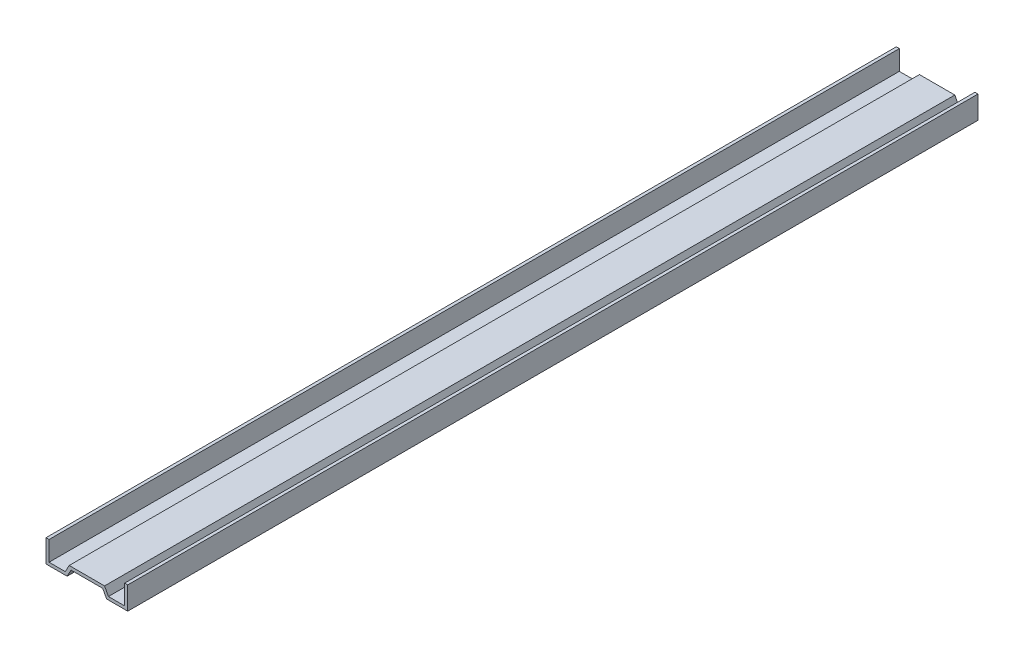
ISO-10303-21;
HEADER;
FILE_DESCRIPTION(('STEP AP214'),'2;1');
FILE_NAME('part.step','',(''),(''),'','','');
FILE_SCHEMA(('AUTOMOTIVE_DESIGN { 1 0 10303 214 1 1 1 1 }'));
ENDSEC;
DATA;
#1=APPLICATION_CONTEXT('core data for automotive mechanical design processes');
#2=APPLICATION_PROTOCOL_DEFINITION('international standard','automotive_design',2000,#1);
#3=PRODUCT_CONTEXT('',#1,'mechanical');
#4=PRODUCT('Part','Part','',(#3));
#5=PRODUCT_RELATED_PRODUCT_CATEGORY('part','',(#4));
#6=PRODUCT_DEFINITION_FORMATION('','',#4);
#7=PRODUCT_DEFINITION_CONTEXT('part definition',#1,'design');
#8=PRODUCT_DEFINITION('design','',#6,#7);
#9=PRODUCT_DEFINITION_SHAPE('','',#8);
#10=(LENGTH_UNIT() NAMED_UNIT(*) SI_UNIT(.MILLI.,.METRE.));
#11=(NAMED_UNIT(*) PLANE_ANGLE_UNIT() SI_UNIT($,.RADIAN.));
#12=(NAMED_UNIT(*) SI_UNIT($,.STERADIAN.) SOLID_ANGLE_UNIT());
#13=UNCERTAINTY_MEASURE_WITH_UNIT(LENGTH_MEASURE(1.E-05),#10,'distance_accuracy_value','');
#14=(GEOMETRIC_REPRESENTATION_CONTEXT(3) GLOBAL_UNCERTAINTY_ASSIGNED_CONTEXT((#13)) GLOBAL_UNIT_ASSIGNED_CONTEXT((#10,
#11,#12)) REPRESENTATION_CONTEXT('',''));
#15=CARTESIAN_POINT('',(0.,0.,0.));
#16=DIRECTION('',(0.,0.,1.));
#17=DIRECTION('',(1.,0.,0.));
#18=AXIS2_PLACEMENT_3D('',#15,#16,#17);
#19=CARTESIAN_POINT('',(-1.88264318030902,-0.957779943038778,135.75));
#20=DIRECTION('',(-0.88244719913486,0.470411458979307,0.));
#21=DIRECTION('',(-0.470411458979307,-0.88244719913486,0.));
#22=AXIS2_PLACEMENT_3D('',#19,#20,#21);
#23=PLANE('',#22);
#24=DIRECTION('',(-0.470411458979307,-0.88244719913486,0.));
#25=VECTOR('',#24,1.);
#26=CARTESIAN_POINT('',(-1.88264318030902,-0.957779943038778,226.25));
#27=LINE('',#26,#25);
#28=CARTESIAN_POINT('',(-1.88264318030902,-0.957779943038778,226.25));
#29=VERTEX_POINT('',#28);
#30=CARTESIAN_POINT('',(-2.29517142198211,-1.73164372649831,226.25));
#31=VERTEX_POINT('',#30);
#32=EDGE_CURVE('E189',#29,#31,#27,.T.);
#33=ORIENTED_EDGE('',*,*,#32,.F.);
#34=DIRECTION('',(0.,0.,1.));
#35=VECTOR('',#34,1.);
#36=CARTESIAN_POINT('',(-1.88264318030902,-0.957779943038778,135.75));
#37=LINE('',#36,#35);
#38=CARTESIAN_POINT('',(-1.88264318030902,-0.957779943038778,135.75));
#39=VERTEX_POINT('',#38);
#40=EDGE_CURVE('E11',#39,#29,#37,.T.);
#41=ORIENTED_EDGE('',*,*,#40,.F.);
#42=DIRECTION('',(-0.470411458979307,-0.88244719913486,0.));
#43=VECTOR('',#42,1.);
#44=CARTESIAN_POINT('',(-1.88264318030902,-0.957779943038778,135.75));
#45=LINE('',#44,#43);
#46=CARTESIAN_POINT('',(-2.29517142198211,-1.73164372649831,135.75));
#47=VERTEX_POINT('',#46);
#48=EDGE_CURVE('E249',#39,#47,#45,.T.);
#49=ORIENTED_EDGE('',*,*,#48,.T.);
#50=DIRECTION('',(0.,0.,1.));
#51=VECTOR('',#50,1.);
#52=CARTESIAN_POINT('',(-2.29517142198211,-1.73164372649831,135.75));
#53=LINE('',#52,#51);
#54=EDGE_CURVE('E41',#47,#31,#53,.T.);
#55=ORIENTED_EDGE('',*,*,#54,.T.);
#56=EDGE_LOOP('',(#33,#41,#49,#55));
#57=FACE_BOUND('',#56,.T.);
#58=ADVANCED_FACE('F38',(#57),#23,.T.);
#59=CARTESIAN_POINT('',(1.88252698306997,-0.957779943038778,135.75));
#60=DIRECTION('',(0.,1.,0.));
#61=DIRECTION('',(-1.,0.,0.));
#62=AXIS2_PLACEMENT_3D('',#59,#60,#61);
#63=PLANE('',#62);
#64=DIRECTION('',(-1.,0.,0.));
#65=VECTOR('',#64,1.);
#66=CARTESIAN_POINT('',(1.88252698306997,-0.957779943038778,226.25));
#67=LINE('',#66,#65);
#68=CARTESIAN_POINT('',(1.88252698306997,-0.957779943038778,226.25));
#69=VERTEX_POINT('',#68);
#70=EDGE_CURVE('E246',#69,#29,#67,.T.);
#71=ORIENTED_EDGE('',*,*,#70,.F.);
#72=DIRECTION('',(0.,0.,1.));
#73=VECTOR('',#72,1.);
#74=CARTESIAN_POINT('',(1.88252698306997,-0.957779943038778,135.75));
#75=LINE('',#74,#73);
#76=CARTESIAN_POINT('',(1.88252698306997,-0.957779943038778,135.75));
#77=VERTEX_POINT('',#76);
#78=EDGE_CURVE('E48',#77,#69,#75,.T.);
#79=ORIENTED_EDGE('',*,*,#78,.F.);
#80=DIRECTION('',(-1.,0.,0.));
#81=VECTOR('',#80,1.);
#82=CARTESIAN_POINT('',(1.88252698306997,-0.957779943038778,135.75));
#83=LINE('',#82,#81);
#84=EDGE_CURVE('E175',#77,#39,#83,.T.);
#85=ORIENTED_EDGE('',*,*,#84,.T.);
#86=ORIENTED_EDGE('',*,*,#40,.T.);
#87=EDGE_LOOP('',(#71,#79,#85,#86));
#88=FACE_BOUND('',#87,.T.);
#89=ADVANCED_FACE('F291',(#88),#63,.T.);
#90=CARTESIAN_POINT('',(2.29499874139688,-1.73164372649831,135.75));
#91=DIRECTION('',(0.8824739354314,0.470361300793567,0.));
#92=DIRECTION('',(-0.470361300793568,0.8824739354314,0.));
#93=AXIS2_PLACEMENT_3D('',#90,#91,#92);
#94=PLANE('',#93);
#95=DIRECTION('',(-0.470361300793568,0.8824739354314,0.));
#96=VECTOR('',#95,1.);
#97=CARTESIAN_POINT('',(2.29499874139688,-1.73164372649831,226.25));
#98=LINE('',#97,#96);
#99=CARTESIAN_POINT('',(2.29499874139688,-1.73164372649831,226.25));
#100=VERTEX_POINT('',#99);
#101=EDGE_CURVE('E161',#100,#69,#98,.T.);
#102=ORIENTED_EDGE('',*,*,#101,.F.);
#103=DIRECTION('',(0.,0.,1.));
#104=VECTOR('',#103,1.);
#105=CARTESIAN_POINT('',(2.29499874139688,-1.73164372649831,135.75));
#106=LINE('',#105,#104);
#107=CARTESIAN_POINT('',(2.29499874139688,-1.73164372649831,135.75));
#108=VERTEX_POINT('',#107);
#109=EDGE_CURVE('E156',#108,#100,#106,.T.);
#110=ORIENTED_EDGE('',*,*,#109,.F.);
#111=DIRECTION('',(-0.470361300793568,0.8824739354314,0.));
#112=VECTOR('',#111,1.);
#113=CARTESIAN_POINT('',(2.29499874139688,-1.73164372649831,135.75));
#114=LINE('',#113,#112);
#115=EDGE_CURVE('E159',#108,#77,#114,.T.);
#116=ORIENTED_EDGE('',*,*,#115,.T.);
#117=ORIENTED_EDGE('',*,*,#78,.T.);
#118=EDGE_LOOP('',(#102,#110,#116,#117));
#119=FACE_BOUND('',#118,.T.);
#120=ADVANCED_FACE('F158',(#119),#94,.T.);
#121=CARTESIAN_POINT('',(4.02494190138047,-1.73164372649831,135.75));
#122=DIRECTION('',(0.,1.,0.));
#123=DIRECTION('',(-1.,0.,0.));
#124=AXIS2_PLACEMENT_3D('',#121,#122,#123);
#125=PLANE('',#124);
#126=DIRECTION('',(-1.,0.,0.));
#127=VECTOR('',#126,1.);
#128=CARTESIAN_POINT('',(4.02494190138047,-1.73164372649831,226.25));
#129=LINE('',#128,#127);
#130=CARTESIAN_POINT('',(4.02494190138047,-1.73164372649831,226.25));
#131=VERTEX_POINT('',#130);
#132=EDGE_CURVE('E241',#131,#100,#129,.T.);
#133=ORIENTED_EDGE('',*,*,#132,.F.);
#134=DIRECTION('',(0.,0.,1.));
#135=VECTOR('',#134,1.);
#136=CARTESIAN_POINT('',(4.02494190138047,-1.73164372649831,135.75));
#137=LINE('',#136,#135);
#138=CARTESIAN_POINT('',(4.02494190138047,-1.73164372649831,135.75));
#139=VERTEX_POINT('',#138);
#140=EDGE_CURVE('E167',#139,#131,#137,.T.);
#141=ORIENTED_EDGE('',*,*,#140,.F.);
#142=DIRECTION('',(-1.,0.,0.));
#143=VECTOR('',#142,1.);
#144=CARTESIAN_POINT('',(4.02494190138047,-1.73164372649831,135.75));
#145=LINE('',#144,#143);
#146=EDGE_CURVE('E173',#139,#108,#145,.T.);
#147=ORIENTED_EDGE('',*,*,#146,.T.);
#148=ORIENTED_EDGE('',*,*,#109,.T.);
#149=EDGE_LOOP('',(#133,#141,#147,#148));
#150=FACE_BOUND('',#149,.T.);
#151=ADVANCED_FACE('F178',(#150),#125,.T.);
#152=CARTESIAN_POINT('',(4.02494190138047,0.368356273501687,135.75));
#153=DIRECTION('',(-1.,0.,0.));
#154=DIRECTION('',(0.,0.,1.));
#155=AXIS2_PLACEMENT_3D('',#152,#153,#154);
#156=PLANE('',#155);
#157=DIRECTION('',(0.,-1.,0.));
#158=VECTOR('',#157,1.);
#159=CARTESIAN_POINT('',(4.02494190138047,0.368356273501687,226.25));
#160=LINE('',#159,#158);
#161=CARTESIAN_POINT('',(4.02494190138047,0.368356273501687,226.25));
#162=VERTEX_POINT('',#161);
#163=EDGE_CURVE('E237',#162,#131,#160,.T.);
#164=ORIENTED_EDGE('',*,*,#163,.F.);
#165=DIRECTION('',(0.,0.,1.));
#166=VECTOR('',#165,1.);
#167=CARTESIAN_POINT('',(4.02494190138047,0.368356273501687,135.75));
#168=LINE('',#167,#166);
#169=CARTESIAN_POINT('',(4.02494190138047,0.368356273501687,135.75));
#170=VERTEX_POINT('',#169);
#171=EDGE_CURVE('E255',#170,#162,#168,.T.);
#172=ORIENTED_EDGE('',*,*,#171,.F.);
#173=DIRECTION('',(0.,-1.,0.));
#174=VECTOR('',#173,1.);
#175=CARTESIAN_POINT('',(4.02494190138047,0.368356273501687,135.75));
#176=LINE('',#175,#174);
#177=EDGE_CURVE('E180',#170,#139,#176,.T.);
#178=ORIENTED_EDGE('',*,*,#177,.T.);
#179=ORIENTED_EDGE('',*,*,#140,.T.);
#180=EDGE_LOOP('',(#164,#172,#178,#179));
#181=FACE_BOUND('',#180,.T.);
#182=ADVANCED_FACE('F304',(#181),#156,.T.);
#183=CARTESIAN_POINT('',(4.34994190138047,0.368356273501687,135.75));
#184=DIRECTION('',(0.,1.,0.));
#185=DIRECTION('',(0.,0.,1.));
#186=AXIS2_PLACEMENT_3D('',#183,#184,#185);
#187=PLANE('',#186);
#188=DIRECTION('',(-1.,0.,0.));
#189=VECTOR('',#188,1.);
#190=CARTESIAN_POINT('',(4.34994190138047,0.368356273501687,226.25));
#191=LINE('',#190,#189);
#192=CARTESIAN_POINT('',(4.34994190138047,0.368356273501687,226.25));
#193=VERTEX_POINT('',#192);
#194=EDGE_CURVE('E233',#193,#162,#191,.T.);
#195=ORIENTED_EDGE('',*,*,#194,.F.);
#196=DIRECTION('',(0.,0.,1.));
#197=VECTOR('',#196,1.);
#198=CARTESIAN_POINT('',(4.34994190138047,0.368356273501687,135.75));
#199=LINE('',#198,#197);
#200=CARTESIAN_POINT('',(4.34994190138047,0.368356273501687,135.75));
#201=VERTEX_POINT('',#200);
#202=EDGE_CURVE('E258',#201,#193,#199,.T.);
#203=ORIENTED_EDGE('',*,*,#202,.F.);
#204=DIRECTION('',(-1.,0.,0.));
#205=VECTOR('',#204,1.);
#206=CARTESIAN_POINT('',(4.34994190138047,0.368356273501687,135.75));
#207=LINE('',#206,#205);
#208=EDGE_CURVE('E183',#201,#170,#207,.T.);
#209=ORIENTED_EDGE('',*,*,#208,.T.);
#210=ORIENTED_EDGE('',*,*,#171,.T.);
#211=EDGE_LOOP('',(#195,#203,#209,#210));
#212=FACE_BOUND('',#211,.T.);
#213=ADVANCED_FACE('F307',(#212),#187,.T.);
#214=CARTESIAN_POINT('',(4.34994190138047,-2.05664372649831,135.75));
#215=DIRECTION('',(1.,0.,0.));
#216=DIRECTION('',(0.,0.,-1.));
#217=AXIS2_PLACEMENT_3D('',#214,#215,#216);
#218=PLANE('',#217);
#219=DIRECTION('',(0.,1.,0.));
#220=VECTOR('',#219,1.);
#221=CARTESIAN_POINT('',(4.34994190138047,-2.05664372649831,226.25));
#222=LINE('',#221,#220);
#223=CARTESIAN_POINT('',(4.34994190138047,-2.05664372649831,226.25));
#224=VERTEX_POINT('',#223);
#225=EDGE_CURVE('E229',#224,#193,#222,.T.);
#226=ORIENTED_EDGE('',*,*,#225,.F.);
#227=DIRECTION('',(0.,0.,1.));
#228=VECTOR('',#227,1.);
#229=CARTESIAN_POINT('',(4.34994190138047,-2.05664372649831,135.75));
#230=LINE('',#229,#228);
#231=CARTESIAN_POINT('',(4.34994190138047,-2.05664372649831,135.75));
#232=VERTEX_POINT('',#231);
#233=EDGE_CURVE('E261',#232,#224,#230,.T.);
#234=ORIENTED_EDGE('',*,*,#233,.F.);
#235=DIRECTION('',(0.,1.,0.));
#236=VECTOR('',#235,1.);
#237=CARTESIAN_POINT('',(4.34994190138047,-2.05664372649831,135.75));
#238=LINE('',#237,#236);
#239=EDGE_CURVE('E488',#232,#201,#238,.T.);
#240=ORIENTED_EDGE('',*,*,#239,.T.);
#241=ORIENTED_EDGE('',*,*,#202,.T.);
#242=EDGE_LOOP('',(#226,#234,#240,#241));
#243=FACE_BOUND('',#242,.T.);
#244=ADVANCED_FACE('F311',(#243),#218,.T.);
#245=CARTESIAN_POINT('',(2.09994190138047,-2.05664372649831,135.75));
#246=DIRECTION('',(0.,-1.,0.));
#247=DIRECTION('',(1.,0.,0.));
#248=AXIS2_PLACEMENT_3D('',#245,#246,#247);
#249=PLANE('',#248);
#250=DIRECTION('',(1.,0.,0.));
#251=VECTOR('',#250,1.);
#252=CARTESIAN_POINT('',(2.09994190138047,-2.05664372649831,226.25));
#253=LINE('',#252,#251);
#254=CARTESIAN_POINT('',(2.09994190138047,-2.05664372649831,226.25));
#255=VERTEX_POINT('',#254);
#256=EDGE_CURVE('E225',#255,#224,#253,.T.);
#257=ORIENTED_EDGE('',*,*,#256,.F.);
#258=DIRECTION('',(0.,0.,1.));
#259=VECTOR('',#258,1.);
#260=CARTESIAN_POINT('',(2.09994190138047,-2.05664372649831,135.75));
#261=LINE('',#260,#259);
#262=CARTESIAN_POINT('',(2.09994190138047,-2.05664372649831,135.75));
#263=VERTEX_POINT('',#262);
#264=EDGE_CURVE('E264',#263,#255,#261,.T.);
#265=ORIENTED_EDGE('',*,*,#264,.F.);
#266=DIRECTION('',(1.,0.,0.));
#267=VECTOR('',#266,1.);
#268=CARTESIAN_POINT('',(2.09994190138047,-2.05664372649831,135.75));
#269=LINE('',#268,#267);
#270=EDGE_CURVE('E484',#263,#232,#269,.T.);
#271=ORIENTED_EDGE('',*,*,#270,.T.);
#272=ORIENTED_EDGE('',*,*,#233,.T.);
#273=EDGE_LOOP('',(#257,#265,#271,#272));
#274=FACE_BOUND('',#273,.T.);
#275=ADVANCED_FACE('F315',(#274),#249,.T.);
#276=CARTESIAN_POINT('',(1.68747014305356,-1.28277994303878,135.75));
#277=DIRECTION('',(-0.8824739354314,-0.470361300793568,0.));
#278=DIRECTION('',(0.470361300793568,-0.8824739354314,0.));
#279=AXIS2_PLACEMENT_3D('',#276,#277,#278);
#280=PLANE('',#279);
#281=DIRECTION('',(0.470361300793568,-0.8824739354314,0.));
#282=VECTOR('',#281,1.);
#283=CARTESIAN_POINT('',(1.68747014305356,-1.28277994303878,226.25));
#284=LINE('',#283,#282);
#285=CARTESIAN_POINT('',(1.68747014305356,-1.28277994303878,226.25));
#286=VERTEX_POINT('',#285);
#287=EDGE_CURVE('E221',#286,#255,#284,.T.);
#288=ORIENTED_EDGE('',*,*,#287,.F.);
#289=DIRECTION('',(0.,0.,1.));
#290=VECTOR('',#289,1.);
#291=CARTESIAN_POINT('',(1.68747014305356,-1.28277994303878,135.75));
#292=LINE('',#291,#290);
#293=CARTESIAN_POINT('',(1.68747014305356,-1.28277994303878,135.75));
#294=VERTEX_POINT('',#293);
#295=EDGE_CURVE('E267',#294,#286,#292,.T.);
#296=ORIENTED_EDGE('',*,*,#295,.F.);
#297=DIRECTION('',(0.470361300793568,-0.8824739354314,0.));
#298=VECTOR('',#297,1.);
#299=CARTESIAN_POINT('',(1.68747014305356,-1.28277994303878,135.75));
#300=LINE('',#299,#298);
#301=EDGE_CURVE('E498',#294,#263,#300,.T.);
#302=ORIENTED_EDGE('',*,*,#301,.T.);
#303=ORIENTED_EDGE('',*,*,#264,.T.);
#304=EDGE_LOOP('',(#288,#296,#302,#303));
#305=FACE_BOUND('',#304,.T.);
#306=ADVANCED_FACE('F319',(#305),#280,.T.);
#307=CARTESIAN_POINT('',(-1.68752985694644,-1.28277994303878,135.75));
#308=DIRECTION('',(0.,-1.,0.));
#309=DIRECTION('',(1.,0.,0.));
#310=AXIS2_PLACEMENT_3D('',#307,#308,#309);
#311=PLANE('',#310);
#312=DIRECTION('',(1.,0.,0.));
#313=VECTOR('',#312,1.);
#314=CARTESIAN_POINT('',(-1.68752985694644,-1.28277994303878,226.25));
#315=LINE('',#314,#313);
#316=CARTESIAN_POINT('',(-1.68752985694644,-1.28277994303878,226.25));
#317=VERTEX_POINT('',#316);
#318=EDGE_CURVE('E217',#317,#286,#315,.T.);
#319=ORIENTED_EDGE('',*,*,#318,.F.);
#320=DIRECTION('',(0.,0.,1.));
#321=VECTOR('',#320,1.);
#322=CARTESIAN_POINT('',(-1.68752985694644,-1.28277994303878,135.75));
#323=LINE('',#322,#321);
#324=CARTESIAN_POINT('',(-1.68752985694644,-1.28277994303878,135.75));
#325=VERTEX_POINT('',#324);
#326=EDGE_CURVE('E270',#325,#317,#323,.T.);
#327=ORIENTED_EDGE('',*,*,#326,.F.);
#328=DIRECTION('',(1.,0.,0.));
#329=VECTOR('',#328,1.);
#330=CARTESIAN_POINT('',(-1.68752985694644,-1.28277994303878,135.75));
#331=LINE('',#330,#329);
#332=EDGE_CURVE('E477',#325,#294,#331,.T.);
#333=ORIENTED_EDGE('',*,*,#332,.T.);
#334=ORIENTED_EDGE('',*,*,#295,.T.);
#335=EDGE_LOOP('',(#319,#327,#333,#334));
#336=FACE_BOUND('',#335,.T.);
#337=ADVANCED_FACE('F323',(#336),#311,.T.);
#338=CARTESIAN_POINT('',(-2.10005809861953,-2.05664372649831,135.75));
#339=DIRECTION('',(0.88244719913486,-0.470411458979307,0.));
#340=DIRECTION('',(0.470411458979307,0.88244719913486,0.));
#341=AXIS2_PLACEMENT_3D('',#338,#339,#340);
#342=PLANE('',#341);
#343=DIRECTION('',(0.470411458979307,0.88244719913486,0.));
#344=VECTOR('',#343,1.);
#345=CARTESIAN_POINT('',(-2.10005809861953,-2.05664372649831,226.25));
#346=LINE('',#345,#344);
#347=CARTESIAN_POINT('',(-2.10005809861953,-2.05664372649831,226.25));
#348=VERTEX_POINT('',#347);
#349=EDGE_CURVE('E213',#348,#317,#346,.T.);
#350=ORIENTED_EDGE('',*,*,#349,.F.);
#351=DIRECTION('',(0.,0.,1.));
#352=VECTOR('',#351,1.);
#353=CARTESIAN_POINT('',(-2.10005809861953,-2.05664372649831,135.75));
#354=LINE('',#353,#352);
#355=CARTESIAN_POINT('',(-2.10005809861953,-2.05664372649831,135.75));
#356=VERTEX_POINT('',#355);
#357=EDGE_CURVE('E273',#356,#348,#354,.T.);
#358=ORIENTED_EDGE('',*,*,#357,.F.);
#359=DIRECTION('',(0.470411458979307,0.88244719913486,0.));
#360=VECTOR('',#359,1.);
#361=CARTESIAN_POINT('',(-2.10005809861953,-2.05664372649831,135.75));
#362=LINE('',#361,#360);
#363=EDGE_CURVE('E473',#356,#325,#362,.T.);
#364=ORIENTED_EDGE('',*,*,#363,.T.);
#365=ORIENTED_EDGE('',*,*,#326,.T.);
#366=EDGE_LOOP('',(#350,#358,#364,#365));
#367=FACE_BOUND('',#366,.T.);
#368=ADVANCED_FACE('F327',(#367),#342,.T.);
#369=CARTESIAN_POINT('',(-4.35005809861953,-2.05664372649831,135.75));
#370=DIRECTION('',(0.,-1.,0.));
#371=DIRECTION('',(0.,0.,-1.));
#372=AXIS2_PLACEMENT_3D('',#369,#370,#371);
#373=PLANE('',#372);
#374=DIRECTION('',(1.,0.,0.));
#375=VECTOR('',#374,1.);
#376=CARTESIAN_POINT('',(-4.35005809861953,-2.05664372649831,226.25));
#377=LINE('',#376,#375);
#378=CARTESIAN_POINT('',(-4.35005809861953,-2.05664372649831,226.25));
#379=VERTEX_POINT('',#378);
#380=EDGE_CURVE('E209',#379,#348,#377,.T.);
#381=ORIENTED_EDGE('',*,*,#380,.F.);
#382=DIRECTION('',(0.,0.,1.));
#383=VECTOR('',#382,1.);
#384=CARTESIAN_POINT('',(-4.35005809861953,-2.05664372649831,135.75));
#385=LINE('',#384,#383);
#386=CARTESIAN_POINT('',(-4.35005809861953,-2.05664372649831,135.75));
#387=VERTEX_POINT('',#386);
#388=EDGE_CURVE('E276',#387,#379,#385,.T.);
#389=ORIENTED_EDGE('',*,*,#388,.F.);
#390=DIRECTION('',(1.,0.,0.));
#391=VECTOR('',#390,1.);
#392=CARTESIAN_POINT('',(-4.35005809861953,-2.05664372649831,135.75));
#393=LINE('',#392,#391);
#394=EDGE_CURVE('E505',#387,#356,#393,.T.);
#395=ORIENTED_EDGE('',*,*,#394,.T.);
#396=ORIENTED_EDGE('',*,*,#357,.T.);
#397=EDGE_LOOP('',(#381,#389,#395,#396));
#398=FACE_BOUND('',#397,.T.);
#399=ADVANCED_FACE('F331',(#398),#373,.T.);
#400=CARTESIAN_POINT('',(-4.35005809861953,0.368356273501686,135.75));
#401=DIRECTION('',(-1.,0.,0.));
#402=DIRECTION('',(0.,0.,1.));
#403=AXIS2_PLACEMENT_3D('',#400,#401,#402);
#404=PLANE('',#403);
#405=DIRECTION('',(0.,-1.,0.));
#406=VECTOR('',#405,1.);
#407=CARTESIAN_POINT('',(-4.35005809861953,0.368356273501686,226.25));
#408=LINE('',#407,#406);
#409=CARTESIAN_POINT('',(-4.35005809861953,0.368356273501686,226.25));
#410=VERTEX_POINT('',#409);
#411=EDGE_CURVE('E205',#410,#379,#408,.T.);
#412=ORIENTED_EDGE('',*,*,#411,.F.);
#413=DIRECTION('',(0.,0.,1.));
#414=VECTOR('',#413,1.);
#415=CARTESIAN_POINT('',(-4.35005809861953,0.368356273501686,135.75));
#416=LINE('',#415,#414);
#417=CARTESIAN_POINT('',(-4.35005809861953,0.368356273501686,135.75));
#418=VERTEX_POINT('',#417);
#419=EDGE_CURVE('E279',#418,#410,#416,.T.);
#420=ORIENTED_EDGE('',*,*,#419,.F.);
#421=DIRECTION('',(0.,-1.,0.));
#422=VECTOR('',#421,1.);
#423=CARTESIAN_POINT('',(-4.35005809861953,0.368356273501686,135.75));
#424=LINE('',#423,#422);
#425=EDGE_CURVE('E466',#418,#387,#424,.T.);
#426=ORIENTED_EDGE('',*,*,#425,.T.);
#427=ORIENTED_EDGE('',*,*,#388,.T.);
#428=EDGE_LOOP('',(#412,#420,#426,#427));
#429=FACE_BOUND('',#428,.T.);
#430=ADVANCED_FACE('F335',(#429),#404,.T.);
#431=CARTESIAN_POINT('',(-4.02505809861953,0.368356273501686,135.75));
#432=DIRECTION('',(0.,1.,0.));
#433=DIRECTION('',(0.,0.,1.));
#434=AXIS2_PLACEMENT_3D('',#431,#432,#433);
#435=PLANE('',#434);
#436=DIRECTION('',(-1.,0.,0.));
#437=VECTOR('',#436,1.);
#438=CARTESIAN_POINT('',(-4.02505809861953,0.368356273501686,226.25));
#439=LINE('',#438,#437);
#440=CARTESIAN_POINT('',(-4.02505809861953,0.368356273501686,226.25));
#441=VERTEX_POINT('',#440);
#442=EDGE_CURVE('E201',#441,#410,#439,.T.);
#443=ORIENTED_EDGE('',*,*,#442,.F.);
#444=DIRECTION('',(0.,0.,1.));
#445=VECTOR('',#444,1.);
#446=CARTESIAN_POINT('',(-4.02505809861953,0.368356273501686,135.75));
#447=LINE('',#446,#445);
#448=CARTESIAN_POINT('',(-4.02505809861953,0.368356273501686,135.75));
#449=VERTEX_POINT('',#448);
#450=EDGE_CURVE('E282',#449,#441,#447,.T.);
#451=ORIENTED_EDGE('',*,*,#450,.F.);
#452=DIRECTION('',(-1.,0.,0.));
#453=VECTOR('',#452,1.);
#454=CARTESIAN_POINT('',(-4.02505809861953,0.368356273501686,135.75));
#455=LINE('',#454,#453);
#456=EDGE_CURVE('E462',#449,#418,#455,.T.);
#457=ORIENTED_EDGE('',*,*,#456,.T.);
#458=ORIENTED_EDGE('',*,*,#419,.T.);
#459=EDGE_LOOP('',(#443,#451,#457,#458));
#460=FACE_BOUND('',#459,.T.);
#461=ADVANCED_FACE('F339',(#460),#435,.T.);
#462=CARTESIAN_POINT('',(-4.02505809861953,-1.73164372649831,135.75));
#463=DIRECTION('',(1.,0.,0.));
#464=DIRECTION('',(0.,0.,-1.));
#465=AXIS2_PLACEMENT_3D('',#462,#463,#464);
#466=PLANE('',#465);
#467=DIRECTION('',(0.,1.,0.));
#468=VECTOR('',#467,1.);
#469=CARTESIAN_POINT('',(-4.02505809861953,-1.73164372649831,226.25));
#470=LINE('',#469,#468);
#471=CARTESIAN_POINT('',(-4.02505809861953,-1.73164372649831,226.25));
#472=VERTEX_POINT('',#471);
#473=EDGE_CURVE('E197',#472,#441,#470,.T.);
#474=ORIENTED_EDGE('',*,*,#473,.F.);
#475=DIRECTION('',(0.,0.,1.));
#476=VECTOR('',#475,1.);
#477=CARTESIAN_POINT('',(-4.02505809861953,-1.73164372649831,135.75));
#478=LINE('',#477,#476);
#479=CARTESIAN_POINT('',(-4.02505809861953,-1.73164372649831,135.75));
#480=VERTEX_POINT('',#479);
#481=EDGE_CURVE('E284',#480,#472,#478,.T.);
#482=ORIENTED_EDGE('',*,*,#481,.F.);
#483=DIRECTION('',(0.,1.,0.));
#484=VECTOR('',#483,1.);
#485=CARTESIAN_POINT('',(-4.02505809861953,-1.73164372649831,135.75));
#486=LINE('',#485,#484);
#487=EDGE_CURVE('E512',#480,#449,#486,.T.);
#488=ORIENTED_EDGE('',*,*,#487,.T.);
#489=ORIENTED_EDGE('',*,*,#450,.T.);
#490=EDGE_LOOP('',(#474,#482,#488,#489));
#491=FACE_BOUND('',#490,.T.);
#492=ADVANCED_FACE('F343',(#491),#466,.T.);
#493=CARTESIAN_POINT('',(-2.29517142198211,-1.73164372649831,135.75));
#494=DIRECTION('',(0.,1.,0.));
#495=DIRECTION('',(-1.,0.,0.));
#496=AXIS2_PLACEMENT_3D('',#493,#494,#495);
#497=PLANE('',#496);
#498=DIRECTION('',(-1.,0.,0.));
#499=VECTOR('',#498,1.);
#500=CARTESIAN_POINT('',(-2.29517142198211,-1.73164372649831,226.25));
#501=LINE('',#500,#499);
#502=EDGE_CURVE('E193',#31,#472,#501,.T.);
#503=ORIENTED_EDGE('',*,*,#502,.F.);
#504=ORIENTED_EDGE('',*,*,#54,.F.);
#505=DIRECTION('',(-1.,0.,0.));
#506=VECTOR('',#505,1.);
#507=CARTESIAN_POINT('',(-2.29517142198211,-1.73164372649831,135.75));
#508=LINE('',#507,#506);
#509=EDGE_CURVE('E515',#47,#480,#508,.T.);
#510=ORIENTED_EDGE('',*,*,#509,.T.);
#511=ORIENTED_EDGE('',*,*,#481,.T.);
#512=EDGE_LOOP('',(#503,#504,#510,#511));
#513=FACE_BOUND('',#512,.T.);
#514=ADVANCED_FACE('F288',(#513),#497,.T.);
#515=CARTESIAN_POINT('',(-5.80986195282774E-05,-0.957779943038778,135.75));
#516=DIRECTION('',(0.,0.,-1.));
#517=DIRECTION('',(-1.,0.,0.));
#518=AXIS2_PLACEMENT_3D('',#515,#516,#517);
#519=PLANE('',#518);
#520=ORIENTED_EDGE('',*,*,#48,.F.);
#521=ORIENTED_EDGE('',*,*,#84,.F.);
#522=ORIENTED_EDGE('',*,*,#115,.F.);
#523=ORIENTED_EDGE('',*,*,#146,.F.);
#524=ORIENTED_EDGE('',*,*,#177,.F.);
#525=ORIENTED_EDGE('',*,*,#208,.F.);
#526=ORIENTED_EDGE('',*,*,#239,.F.);
#527=ORIENTED_EDGE('',*,*,#270,.F.);
#528=ORIENTED_EDGE('',*,*,#301,.F.);
#529=ORIENTED_EDGE('',*,*,#332,.F.);
#530=ORIENTED_EDGE('',*,*,#363,.F.);
#531=ORIENTED_EDGE('',*,*,#394,.F.);
#532=ORIENTED_EDGE('',*,*,#425,.F.);
#533=ORIENTED_EDGE('',*,*,#456,.F.);
#534=ORIENTED_EDGE('',*,*,#487,.F.);
#535=ORIENTED_EDGE('',*,*,#509,.F.);
#536=EDGE_LOOP('',(#520,#521,#522,#523,#524,#525,#526,#527,#528,#529,#530,#531,#532,#533,#534,#535));
#537=FACE_BOUND('',#536,.T.);
#538=ADVANCED_FACE('F171',(#537),#519,.T.);
#539=CARTESIAN_POINT('',(-5.80986195282774E-05,-0.957779943038778,226.25));
#540=DIRECTION('',(0.,0.,-1.));
#541=DIRECTION('',(-1.,0.,0.));
#542=AXIS2_PLACEMENT_3D('',#539,#540,#541);
#543=PLANE('',#542);
#544=ORIENTED_EDGE('',*,*,#32,.T.);
#545=ORIENTED_EDGE('',*,*,#502,.T.);
#546=ORIENTED_EDGE('',*,*,#473,.T.);
#547=ORIENTED_EDGE('',*,*,#442,.T.);
#548=ORIENTED_EDGE('',*,*,#411,.T.);
#549=ORIENTED_EDGE('',*,*,#380,.T.);
#550=ORIENTED_EDGE('',*,*,#349,.T.);
#551=ORIENTED_EDGE('',*,*,#318,.T.);
#552=ORIENTED_EDGE('',*,*,#287,.T.);
#553=ORIENTED_EDGE('',*,*,#256,.T.);
#554=ORIENTED_EDGE('',*,*,#225,.T.);
#555=ORIENTED_EDGE('',*,*,#194,.T.);
#556=ORIENTED_EDGE('',*,*,#163,.T.);
#557=ORIENTED_EDGE('',*,*,#132,.T.);
#558=ORIENTED_EDGE('',*,*,#101,.T.);
#559=ORIENTED_EDGE('',*,*,#70,.T.);
#560=EDGE_LOOP('',(#544,#545,#546,#547,#548,#549,#550,#551,#552,#553,#554,#555,#556,#557,#558,#559));
#561=FACE_BOUND('',#560,.T.);
#562=ADVANCED_FACE('F290',(#561),#543,.F.);
#563=CLOSED_SHELL('',(#58,#89,#120,#151,#182,#213,#244,#275,#306,#337,#368,#399,#430,#461,#492,
#514,#538,#562));
#564=MANIFOLD_SOLID_BREP('B2',#563);
#565=ADVANCED_BREP_SHAPE_REPRESENTATION('',(#18,#564),#14);
#566=SHAPE_DEFINITION_REPRESENTATION(#9,#565);
ENDSEC;
END-ISO-10303-21;
